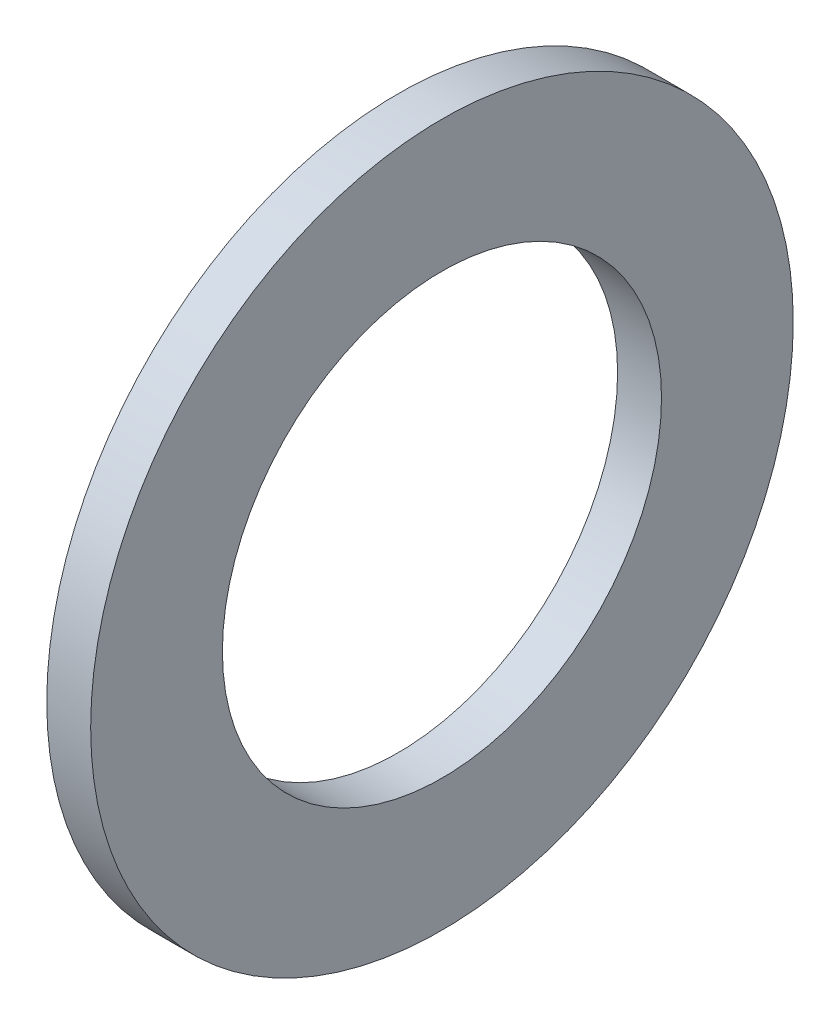
ISO-10303-21;
HEADER;
FILE_DESCRIPTION(('STEP AP214'),'2;1');
FILE_NAME('part.step','',(''),(''),'','','');
FILE_SCHEMA(('AUTOMOTIVE_DESIGN { 1 0 10303 214 1 1 1 1 }'));
ENDSEC;
DATA;
#1=APPLICATION_CONTEXT('core data for automotive mechanical design processes');
#2=APPLICATION_PROTOCOL_DEFINITION('international standard','automotive_design',2000,#1);
#3=PRODUCT_CONTEXT('',#1,'mechanical');
#4=PRODUCT('Part','Part','',(#3));
#5=PRODUCT_RELATED_PRODUCT_CATEGORY('part','',(#4));
#6=PRODUCT_DEFINITION_FORMATION('','',#4);
#7=PRODUCT_DEFINITION_CONTEXT('part definition',#1,'design');
#8=PRODUCT_DEFINITION('design','',#6,#7);
#9=PRODUCT_DEFINITION_SHAPE('','',#8);
#10=(LENGTH_UNIT() NAMED_UNIT(*) SI_UNIT(.MILLI.,.METRE.));
#11=(NAMED_UNIT(*) PLANE_ANGLE_UNIT() SI_UNIT($,.RADIAN.));
#12=(NAMED_UNIT(*) SI_UNIT($,.STERADIAN.) SOLID_ANGLE_UNIT());
#13=UNCERTAINTY_MEASURE_WITH_UNIT(LENGTH_MEASURE(1.E-05),#10,'distance_accuracy_value','');
#14=(GEOMETRIC_REPRESENTATION_CONTEXT(3) GLOBAL_UNCERTAINTY_ASSIGNED_CONTEXT((#13)) GLOBAL_UNIT_ASSIGNED_CONTEXT((#10,
#11,#12)) REPRESENTATION_CONTEXT('',''));
#15=CARTESIAN_POINT('',(0.,0.,0.));
#16=DIRECTION('',(0.,0.,1.));
#17=DIRECTION('',(1.,0.,0.));
#18=AXIS2_PLACEMENT_3D('',#15,#16,#17);
#19=CARTESIAN_POINT('',(5.,0.,0.));
#20=DIRECTION('',(1.,0.,0.));
#21=DIRECTION('',(0.,0.,-1.));
#22=AXIS2_PLACEMENT_3D('',#19,#20,#21);
#23=PLANE('',#22);
#24=CARTESIAN_POINT('',(5.,0.,0.));
#25=DIRECTION('',(1.,0.,0.));
#26=DIRECTION('',(0.,0.,-1.));
#27=AXIS2_PLACEMENT_3D('',#24,#25,#26);
#28=CIRCLE('',#27,40.);
#29=CARTESIAN_POINT('',(5.,0.,-40.));
#30=VERTEX_POINT('',#29);
#31=EDGE_CURVE('E10',#30,#30,#28,.T.);
#32=ORIENTED_EDGE('',*,*,#31,.T.);
#33=EDGE_LOOP('',(#32));
#34=FACE_BOUND('',#33,.T.);
#35=CARTESIAN_POINT('',(5.,0.,0.));
#36=DIRECTION('',(1.,0.,0.));
#37=DIRECTION('',(0.,0.,-1.));
#38=AXIS2_PLACEMENT_3D('',#35,#36,#37);
#39=CIRCLE('',#38,25.);
#40=CARTESIAN_POINT('',(5.,0.,-25.));
#41=VERTEX_POINT('',#40);
#42=EDGE_CURVE('E41',#41,#41,#39,.T.);
#43=ORIENTED_EDGE('',*,*,#42,.F.);
#44=EDGE_LOOP('',(#43));
#45=FACE_BOUND('',#44,.T.);
#46=ADVANCED_FACE('F30',(#34,#45),#23,.T.);
#47=CARTESIAN_POINT('',(0.,0.,0.));
#48=DIRECTION('',(1.,0.,0.));
#49=DIRECTION('',(0.,0.,-1.));
#50=AXIS2_PLACEMENT_3D('',#47,#48,#49);
#51=PLANE('',#50);
#52=CARTESIAN_POINT('',(0.,0.,0.));
#53=DIRECTION('',(1.,0.,0.));
#54=DIRECTION('',(0.,0.,-1.));
#55=AXIS2_PLACEMENT_3D('',#52,#53,#54);
#56=CIRCLE('',#55,40.);
#57=CARTESIAN_POINT('',(0.,0.,-40.));
#58=VERTEX_POINT('',#57);
#59=EDGE_CURVE('E34',#58,#58,#56,.T.);
#60=ORIENTED_EDGE('',*,*,#59,.F.);
#61=EDGE_LOOP('',(#60));
#62=FACE_BOUND('',#61,.T.);
#63=CARTESIAN_POINT('',(0.,0.,0.));
#64=DIRECTION('',(1.,0.,0.));
#65=DIRECTION('',(0.,0.,-1.));
#66=AXIS2_PLACEMENT_3D('',#63,#64,#65);
#67=CIRCLE('',#66,25.);
#68=CARTESIAN_POINT('',(0.,0.,-25.));
#69=VERTEX_POINT('',#68);
#70=EDGE_CURVE('E43',#69,#69,#67,.T.);
#71=ORIENTED_EDGE('',*,*,#70,.T.);
#72=EDGE_LOOP('',(#71));
#73=FACE_BOUND('',#72,.T.);
#74=ADVANCED_FACE('F53',(#62,#73),#51,.F.);
#75=CARTESIAN_POINT('',(5.,0.,0.));
#76=DIRECTION('',(-1.,0.,0.));
#77=DIRECTION('',(0.,0.,1.));
#78=AXIS2_PLACEMENT_3D('',#75,#76,#77);
#79=CYLINDRICAL_SURFACE('',#78,40.);
#80=ORIENTED_EDGE('',*,*,#31,.F.);
#81=EDGE_LOOP('',(#80));
#82=FACE_BOUND('',#81,.T.);
#83=ORIENTED_EDGE('',*,*,#59,.T.);
#84=EDGE_LOOP('',(#83));
#85=FACE_BOUND('',#84,.T.);
#86=ADVANCED_FACE('F32',(#82,#85),#79,.T.);
#87=CARTESIAN_POINT('',(5.,0.,0.));
#88=DIRECTION('',(-1.,0.,0.));
#89=DIRECTION('',(0.,0.,1.));
#90=AXIS2_PLACEMENT_3D('',#87,#88,#89);
#91=CYLINDRICAL_SURFACE('',#90,25.);
#92=ORIENTED_EDGE('',*,*,#42,.T.);
#93=EDGE_LOOP('',(#92));
#94=FACE_BOUND('',#93,.T.);
#95=ORIENTED_EDGE('',*,*,#70,.F.);
#96=EDGE_LOOP('',(#95));
#97=FACE_BOUND('',#96,.T.);
#98=ADVANCED_FACE('F49',(#94,#97),#91,.F.);
#99=CLOSED_SHELL('',(#46,#74,#86,#98));
#100=MANIFOLD_SOLID_BREP('B2',#99);
#101=ADVANCED_BREP_SHAPE_REPRESENTATION('',(#18,#100),#14);
#102=SHAPE_DEFINITION_REPRESENTATION(#9,#101);
ENDSEC;
END-ISO-10303-21;
